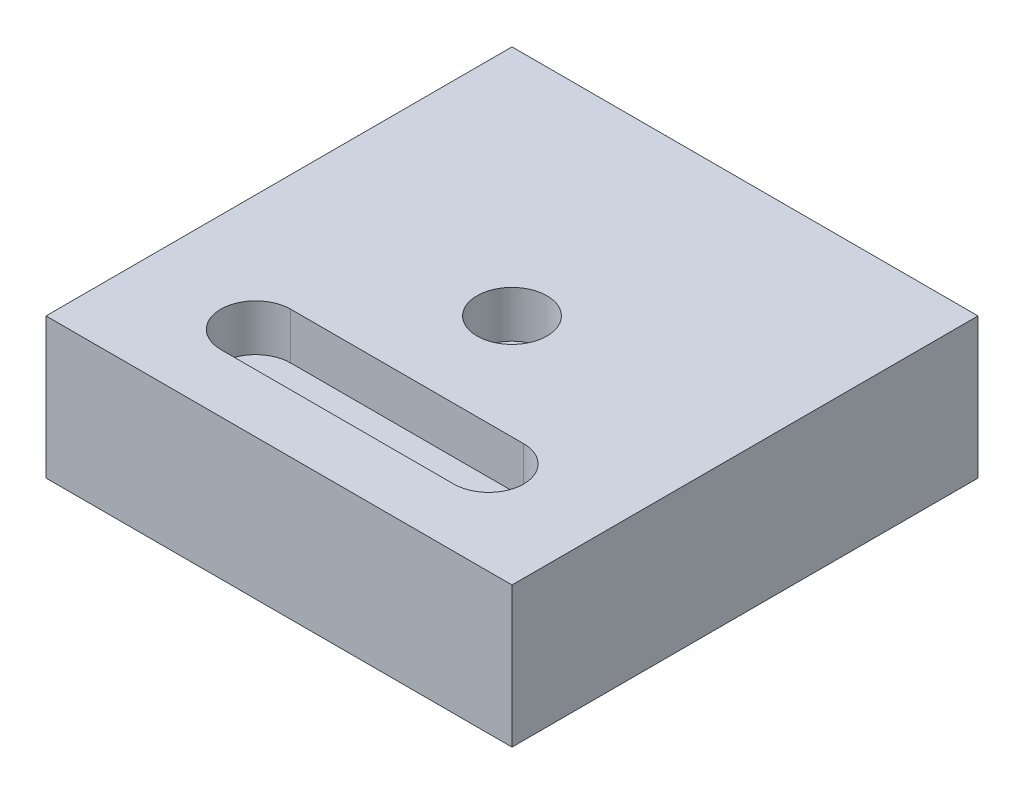
ISO-10303-21;
HEADER;
FILE_DESCRIPTION(('STEP AP214'),'2;1');
FILE_NAME('part.step','',(''),(''),'','','');
FILE_SCHEMA(('AUTOMOTIVE_DESIGN { 1 0 10303 214 1 1 1 1 }'));
ENDSEC;
DATA;
#1=APPLICATION_CONTEXT('core data for automotive mechanical design processes');
#2=APPLICATION_PROTOCOL_DEFINITION('international standard','automotive_design',2000,#1);
#3=PRODUCT_CONTEXT('',#1,'mechanical');
#4=PRODUCT('Part','Part','',(#3));
#5=PRODUCT_RELATED_PRODUCT_CATEGORY('part','',(#4));
#6=PRODUCT_DEFINITION_FORMATION('','',#4);
#7=PRODUCT_DEFINITION_CONTEXT('part definition',#1,'design');
#8=PRODUCT_DEFINITION('design','',#6,#7);
#9=PRODUCT_DEFINITION_SHAPE('','',#8);
#10=(LENGTH_UNIT() NAMED_UNIT(*) SI_UNIT(.MILLI.,.METRE.));
#11=(NAMED_UNIT(*) PLANE_ANGLE_UNIT() SI_UNIT($,.RADIAN.));
#12=(NAMED_UNIT(*) SI_UNIT($,.STERADIAN.) SOLID_ANGLE_UNIT());
#13=UNCERTAINTY_MEASURE_WITH_UNIT(LENGTH_MEASURE(1.E-05),#10,'distance_accuracy_value','');
#14=(GEOMETRIC_REPRESENTATION_CONTEXT(3) GLOBAL_UNCERTAINTY_ASSIGNED_CONTEXT((#13)) GLOBAL_UNIT_ASSIGNED_CONTEXT((#10,
#11,#12)) REPRESENTATION_CONTEXT('',''));
#15=CARTESIAN_POINT('',(0.,0.,0.));
#16=DIRECTION('',(0.,0.,1.));
#17=DIRECTION('',(1.,0.,0.));
#18=AXIS2_PLACEMENT_3D('',#15,#16,#17);
#19=CARTESIAN_POINT('',(50.,30.144123076788,50.));
#20=DIRECTION('',(-1.,0.,0.));
#21=DIRECTION('',(0.,0.,1.));
#22=AXIS2_PLACEMENT_3D('',#19,#20,#21);
#23=PLANE('',#22);
#24=DIRECTION('',(0.,0.,-1.));
#25=VECTOR('',#24,1.);
#26=CARTESIAN_POINT('',(50.,0.,50.));
#27=LINE('',#26,#25);
#28=CARTESIAN_POINT('',(50.,0.,50.));
#29=VERTEX_POINT('',#28);
#30=CARTESIAN_POINT('',(50.,0.,-50.));
#31=VERTEX_POINT('',#30);
#32=EDGE_CURVE('E194',#29,#31,#27,.T.);
#33=ORIENTED_EDGE('',*,*,#32,.T.);
#34=DIRECTION('',(0.,-1.,0.));
#35=VECTOR('',#34,1.);
#36=CARTESIAN_POINT('',(50.,30.144123076788,-50.));
#37=LINE('',#36,#35);
#38=CARTESIAN_POINT('',(50.,30.144123076788,-50.));
#39=VERTEX_POINT('',#38);
#40=EDGE_CURVE('E12',#39,#31,#37,.T.);
#41=ORIENTED_EDGE('',*,*,#40,.F.);
#42=DIRECTION('',(0.,0.,-1.));
#43=VECTOR('',#42,1.);
#44=CARTESIAN_POINT('',(50.,30.144123076788,50.));
#45=LINE('',#44,#43);
#46=CARTESIAN_POINT('',(50.,30.144123076788,50.));
#47=VERTEX_POINT('',#46);
#48=EDGE_CURVE('E187',#47,#39,#45,.T.);
#49=ORIENTED_EDGE('',*,*,#48,.F.);
#50=DIRECTION('',(0.,-1.,0.));
#51=VECTOR('',#50,1.);
#52=CARTESIAN_POINT('',(50.,30.144123076788,50.));
#53=LINE('',#52,#51);
#54=EDGE_CURVE('E193',#47,#29,#53,.T.);
#55=ORIENTED_EDGE('',*,*,#54,.T.);
#56=EDGE_LOOP('',(#33,#41,#49,#55));
#57=FACE_BOUND('',#56,.T.);
#58=ADVANCED_FACE('F73',(#57),#23,.F.);
#59=CARTESIAN_POINT('',(-50.,30.144123076788,-50.));
#60=DIRECTION('',(0.,0.,1.));
#61=DIRECTION('',(1.,0.,0.));
#62=AXIS2_PLACEMENT_3D('',#59,#60,#61);
#63=PLANE('',#62);
#64=DIRECTION('',(-1.,0.,0.));
#65=VECTOR('',#64,1.);
#66=CARTESIAN_POINT('',(-50.,0.,-50.));
#67=LINE('',#66,#65);
#68=CARTESIAN_POINT('',(-50.,0.,-50.));
#69=VERTEX_POINT('',#68);
#70=EDGE_CURVE('E197',#31,#69,#67,.T.);
#71=ORIENTED_EDGE('',*,*,#70,.T.);
#72=DIRECTION('',(0.,-1.,0.));
#73=VECTOR('',#72,1.);
#74=CARTESIAN_POINT('',(-50.,30.144123076788,-50.));
#75=LINE('',#74,#73);
#76=CARTESIAN_POINT('',(-50.,30.144123076788,-50.));
#77=VERTEX_POINT('',#76);
#78=EDGE_CURVE('E80',#77,#69,#75,.T.);
#79=ORIENTED_EDGE('',*,*,#78,.F.);
#80=DIRECTION('',(-1.,0.,0.));
#81=VECTOR('',#80,1.);
#82=CARTESIAN_POINT('',(-50.,30.144123076788,-50.));
#83=LINE('',#82,#81);
#84=EDGE_CURVE('E124',#39,#77,#83,.T.);
#85=ORIENTED_EDGE('',*,*,#84,.F.);
#86=ORIENTED_EDGE('',*,*,#40,.T.);
#87=EDGE_LOOP('',(#71,#79,#85,#86));
#88=FACE_BOUND('',#87,.T.);
#89=ADVANCED_FACE('F227',(#88),#63,.F.);
#90=CARTESIAN_POINT('',(-50.,30.144123076788,50.));
#91=DIRECTION('',(1.,0.,0.));
#92=DIRECTION('',(0.,0.,-1.));
#93=AXIS2_PLACEMENT_3D('',#90,#91,#92);
#94=PLANE('',#93);
#95=DIRECTION('',(0.,0.,1.));
#96=VECTOR('',#95,1.);
#97=CARTESIAN_POINT('',(-50.,0.,50.));
#98=LINE('',#97,#96);
#99=CARTESIAN_POINT('',(-50.,0.,50.));
#100=VERTEX_POINT('',#99);
#101=EDGE_CURVE('E200',#69,#100,#98,.T.);
#102=ORIENTED_EDGE('',*,*,#101,.T.);
#103=DIRECTION('',(0.,-1.,0.));
#104=VECTOR('',#103,1.);
#105=CARTESIAN_POINT('',(-50.,30.144123076788,50.));
#106=LINE('',#105,#104);
#107=CARTESIAN_POINT('',(-50.,30.144123076788,50.));
#108=VERTEX_POINT('',#107);
#109=EDGE_CURVE('E204',#108,#100,#106,.T.);
#110=ORIENTED_EDGE('',*,*,#109,.F.);
#111=DIRECTION('',(0.,0.,1.));
#112=VECTOR('',#111,1.);
#113=CARTESIAN_POINT('',(-50.,30.144123076788,50.));
#114=LINE('',#113,#112);
#115=EDGE_CURVE('E190',#77,#108,#114,.T.);
#116=ORIENTED_EDGE('',*,*,#115,.F.);
#117=ORIENTED_EDGE('',*,*,#78,.T.);
#118=EDGE_LOOP('',(#102,#110,#116,#117));
#119=FACE_BOUND('',#118,.T.);
#120=ADVANCED_FACE('F209',(#119),#94,.F.);
#121=CARTESIAN_POINT('',(-50.,30.144123076788,50.));
#122=DIRECTION('',(0.,0.,-1.));
#123=DIRECTION('',(-1.,0.,0.));
#124=AXIS2_PLACEMENT_3D('',#121,#122,#123);
#125=PLANE('',#124);
#126=DIRECTION('',(1.,0.,0.));
#127=VECTOR('',#126,1.);
#128=CARTESIAN_POINT('',(-50.,0.,50.));
#129=LINE('',#128,#127);
#130=EDGE_CURVE('E117',#100,#29,#129,.T.);
#131=ORIENTED_EDGE('',*,*,#130,.T.);
#132=ORIENTED_EDGE('',*,*,#54,.F.);
#133=DIRECTION('',(1.,0.,0.));
#134=VECTOR('',#133,1.);
#135=CARTESIAN_POINT('',(-50.,30.144123076788,50.));
#136=LINE('',#135,#134);
#137=EDGE_CURVE('E96',#108,#47,#136,.T.);
#138=ORIENTED_EDGE('',*,*,#137,.F.);
#139=ORIENTED_EDGE('',*,*,#109,.T.);
#140=EDGE_LOOP('',(#131,#132,#138,#139));
#141=FACE_BOUND('',#140,.T.);
#142=ADVANCED_FACE('F217',(#141),#125,.F.);
#143=CARTESIAN_POINT('',(0.,30.144123076788,0.));
#144=DIRECTION('',(0.,-1.,0.));
#145=DIRECTION('',(0.,0.,-1.));
#146=AXIS2_PLACEMENT_3D('',#143,#144,#145);
#147=PLANE('',#146);
#148=CARTESIAN_POINT('',(0.,30.144123076788,0.));
#149=DIRECTION('',(0.,1.,0.));
#150=DIRECTION('',(0.,0.,1.));
#151=AXIS2_PLACEMENT_3D('',#148,#149,#150);
#152=CIRCLE('',#151,7.5);
#153=CARTESIAN_POINT('',(0.,30.144123076788,7.5));
#154=VERTEX_POINT('',#153);
#155=EDGE_CURVE('E172',#154,#154,#152,.T.);
#156=ORIENTED_EDGE('',*,*,#155,.F.);
#157=EDGE_LOOP('',(#156));
#158=FACE_BOUND('',#157,.T.);
#159=DIRECTION('',(1.,0.,0.));
#160=VECTOR('',#159,1.);
#161=CARTESIAN_POINT('',(-25.,30.144123076788,37.5));
#162=LINE('',#161,#160);
#163=CARTESIAN_POINT('',(-25.,30.144123076788,37.5));
#164=VERTEX_POINT('',#163);
#165=CARTESIAN_POINT('',(25.,30.144123076788,37.5));
#166=VERTEX_POINT('',#165);
#167=EDGE_CURVE('E178',#164,#166,#162,.T.);
#168=ORIENTED_EDGE('',*,*,#167,.F.);
#169=CARTESIAN_POINT('',(-25.,30.144123076788,30.));
#170=DIRECTION('',(0.,1.,0.));
#171=DIRECTION('',(0.,0.,1.));
#172=AXIS2_PLACEMENT_3D('',#169,#170,#171);
#173=CIRCLE('',#172,7.5);
#174=CARTESIAN_POINT('',(-25.,30.144123076788,22.5));
#175=VERTEX_POINT('',#174);
#176=EDGE_CURVE('E87',#175,#164,#173,.T.);
#177=ORIENTED_EDGE('',*,*,#176,.F.);
#178=DIRECTION('',(-1.,0.,0.));
#179=VECTOR('',#178,1.);
#180=CARTESIAN_POINT('',(-25.,30.144123076788,22.5));
#181=LINE('',#180,#179);
#182=CARTESIAN_POINT('',(25.,30.144123076788,22.5));
#183=VERTEX_POINT('',#182);
#184=EDGE_CURVE('E166',#183,#175,#181,.T.);
#185=ORIENTED_EDGE('',*,*,#184,.F.);
#186=CARTESIAN_POINT('',(25.,30.144123076788,30.));
#187=DIRECTION('',(0.,1.,0.));
#188=DIRECTION('',(0.,0.,1.));
#189=AXIS2_PLACEMENT_3D('',#186,#187,#188);
#190=CIRCLE('',#189,7.5);
#191=EDGE_CURVE('E169',#166,#183,#190,.T.);
#192=ORIENTED_EDGE('',*,*,#191,.F.);
#193=EDGE_LOOP('',(#168,#177,#185,#192));
#194=FACE_BOUND('',#193,.T.);
#195=ORIENTED_EDGE('',*,*,#48,.T.);
#196=ORIENTED_EDGE('',*,*,#84,.T.);
#197=ORIENTED_EDGE('',*,*,#115,.T.);
#198=ORIENTED_EDGE('',*,*,#137,.T.);
#199=EDGE_LOOP('',(#195,#196,#197,#198));
#200=FACE_BOUND('',#199,.T.);
#201=ADVANCED_FACE('F219',(#158,#194,#200),#147,.F.);
#202=CARTESIAN_POINT('',(0.,0.,0.));
#203=DIRECTION('',(0.,-1.,0.));
#204=DIRECTION('',(0.,0.,-1.));
#205=AXIS2_PLACEMENT_3D('',#202,#203,#204);
#206=PLANE('',#205);
#207=ORIENTED_EDGE('',*,*,#32,.F.);
#208=ORIENTED_EDGE('',*,*,#130,.F.);
#209=ORIENTED_EDGE('',*,*,#101,.F.);
#210=ORIENTED_EDGE('',*,*,#70,.F.);
#211=EDGE_LOOP('',(#207,#208,#209,#210));
#212=FACE_BOUND('',#211,.T.);
#213=ADVANCED_FACE('F213',(#212),#206,.T.);
#214=CARTESIAN_POINT('',(-25.,20.144123076788,30.));
#215=DIRECTION('',(0.,1.,0.));
#216=DIRECTION('',(0.,0.,1.));
#217=AXIS2_PLACEMENT_3D('',#214,#215,#216);
#218=CYLINDRICAL_SURFACE('',#217,7.5);
#219=ORIENTED_EDGE('',*,*,#176,.T.);
#220=DIRECTION('',(0.,1.,0.));
#221=VECTOR('',#220,1.);
#222=CARTESIAN_POINT('',(-25.,20.144123076788,37.5));
#223=LINE('',#222,#221);
#224=CARTESIAN_POINT('',(-25.,20.144123076788,37.5));
#225=VERTEX_POINT('',#224);
#226=EDGE_CURVE('E144',#225,#164,#223,.T.);
#227=ORIENTED_EDGE('',*,*,#226,.F.);
#228=CARTESIAN_POINT('',(-25.,20.144123076788,30.));
#229=DIRECTION('',(0.,1.,0.));
#230=DIRECTION('',(0.,0.,1.));
#231=AXIS2_PLACEMENT_3D('',#228,#229,#230);
#232=CIRCLE('',#231,7.5);
#233=CARTESIAN_POINT('',(-25.,20.144123076788,22.5));
#234=VERTEX_POINT('',#233);
#235=EDGE_CURVE('E148',#234,#225,#232,.T.);
#236=ORIENTED_EDGE('',*,*,#235,.F.);
#237=DIRECTION('',(0.,1.,0.));
#238=VECTOR('',#237,1.);
#239=CARTESIAN_POINT('',(-25.,20.144123076788,22.5));
#240=LINE('',#239,#238);
#241=EDGE_CURVE('E182',#234,#175,#240,.T.);
#242=ORIENTED_EDGE('',*,*,#241,.T.);
#243=EDGE_LOOP('',(#219,#227,#236,#242));
#244=FACE_BOUND('',#243,.T.);
#245=ADVANCED_FACE('F146',(#244),#218,.F.);
#246=CARTESIAN_POINT('',(-25.,20.144123076788,22.5));
#247=DIRECTION('',(0.,0.,-1.));
#248=DIRECTION('',(-1.,0.,0.));
#249=AXIS2_PLACEMENT_3D('',#246,#247,#248);
#250=PLANE('',#249);
#251=ORIENTED_EDGE('',*,*,#184,.T.);
#252=ORIENTED_EDGE('',*,*,#241,.F.);
#253=DIRECTION('',(-1.,0.,0.));
#254=VECTOR('',#253,1.);
#255=CARTESIAN_POINT('',(-25.,20.144123076788,22.5));
#256=LINE('',#255,#254);
#257=CARTESIAN_POINT('',(25.,20.144123076788,22.5));
#258=VERTEX_POINT('',#257);
#259=EDGE_CURVE('E154',#258,#234,#256,.T.);
#260=ORIENTED_EDGE('',*,*,#259,.F.);
#261=DIRECTION('',(0.,1.,0.));
#262=VECTOR('',#261,1.);
#263=CARTESIAN_POINT('',(25.,20.144123076788,22.5));
#264=LINE('',#263,#262);
#265=EDGE_CURVE('E184',#258,#183,#264,.T.);
#266=ORIENTED_EDGE('',*,*,#265,.T.);
#267=EDGE_LOOP('',(#251,#252,#260,#266));
#268=FACE_BOUND('',#267,.T.);
#269=ADVANCED_FACE('F266',(#268),#250,.F.);
#270=CARTESIAN_POINT('',(25.,20.144123076788,30.));
#271=DIRECTION('',(0.,1.,0.));
#272=DIRECTION('',(0.,0.,1.));
#273=AXIS2_PLACEMENT_3D('',#270,#271,#272);
#274=CYLINDRICAL_SURFACE('',#273,7.5);
#275=ORIENTED_EDGE('',*,*,#191,.T.);
#276=ORIENTED_EDGE('',*,*,#265,.F.);
#277=CARTESIAN_POINT('',(25.,20.144123076788,30.));
#278=DIRECTION('',(0.,1.,0.));
#279=DIRECTION('',(0.,0.,1.));
#280=AXIS2_PLACEMENT_3D('',#277,#278,#279);
#281=CIRCLE('',#280,7.5);
#282=CARTESIAN_POINT('',(25.,20.144123076788,37.5));
#283=VERTEX_POINT('',#282);
#284=EDGE_CURVE('E162',#283,#258,#281,.T.);
#285=ORIENTED_EDGE('',*,*,#284,.F.);
#286=DIRECTION('',(0.,1.,0.));
#287=VECTOR('',#286,1.);
#288=CARTESIAN_POINT('',(25.,20.144123076788,37.5));
#289=LINE('',#288,#287);
#290=EDGE_CURVE('E153',#283,#166,#289,.T.);
#291=ORIENTED_EDGE('',*,*,#290,.T.);
#292=EDGE_LOOP('',(#275,#276,#285,#291));
#293=FACE_BOUND('',#292,.T.);
#294=ADVANCED_FACE('F275',(#293),#274,.F.);
#295=CARTESIAN_POINT('',(-25.,20.144123076788,37.5));
#296=DIRECTION('',(0.,0.,1.));
#297=DIRECTION('',(1.,0.,0.));
#298=AXIS2_PLACEMENT_3D('',#295,#296,#297);
#299=PLANE('',#298);
#300=ORIENTED_EDGE('',*,*,#167,.T.);
#301=ORIENTED_EDGE('',*,*,#290,.F.);
#302=DIRECTION('',(1.,0.,0.));
#303=VECTOR('',#302,1.);
#304=CARTESIAN_POINT('',(-25.,20.144123076788,37.5));
#305=LINE('',#304,#303);
#306=EDGE_CURVE('E157',#225,#283,#305,.T.);
#307=ORIENTED_EDGE('',*,*,#306,.F.);
#308=ORIENTED_EDGE('',*,*,#226,.T.);
#309=EDGE_LOOP('',(#300,#301,#307,#308));
#310=FACE_BOUND('',#309,.T.);
#311=ADVANCED_FACE('F158',(#310),#299,.F.);
#312=CARTESIAN_POINT('',(-25.,20.144123076788,30.));
#313=DIRECTION('',(0.,1.,0.));
#314=DIRECTION('',(0.,0.,1.));
#315=AXIS2_PLACEMENT_3D('',#312,#313,#314);
#316=PLANE('',#315);
#317=ORIENTED_EDGE('',*,*,#235,.T.);
#318=ORIENTED_EDGE('',*,*,#306,.T.);
#319=ORIENTED_EDGE('',*,*,#284,.T.);
#320=ORIENTED_EDGE('',*,*,#259,.T.);
#321=EDGE_LOOP('',(#317,#318,#319,#320));
#322=FACE_BOUND('',#321,.T.);
#323=ADVANCED_FACE('F164',(#322),#316,.T.);
#324=CARTESIAN_POINT('',(0.,20.144123076788,0.));
#325=DIRECTION('',(0.,1.,0.));
#326=DIRECTION('',(0.,0.,1.));
#327=AXIS2_PLACEMENT_3D('',#324,#325,#326);
#328=CYLINDRICAL_SURFACE('',#327,7.5);
#329=CARTESIAN_POINT('',(0.,20.144123076788,0.));
#330=DIRECTION('',(0.,1.,0.));
#331=DIRECTION('',(0.,0.,1.));
#332=AXIS2_PLACEMENT_3D('',#329,#330,#331);
#333=CIRCLE('',#332,7.5);
#334=CARTESIAN_POINT('',(0.,20.144123076788,7.5));
#335=VERTEX_POINT('',#334);
#336=EDGE_CURVE('E198',#335,#335,#333,.T.);
#337=ORIENTED_EDGE('',*,*,#336,.F.);
#338=EDGE_LOOP('',(#337));
#339=FACE_BOUND('',#338,.T.);
#340=ORIENTED_EDGE('',*,*,#155,.T.);
#341=EDGE_LOOP('',(#340));
#342=FACE_BOUND('',#341,.T.);
#343=ADVANCED_FACE('F302',(#339,#342),#328,.F.);
#344=CARTESIAN_POINT('',(0.,20.144123076788,0.));
#345=DIRECTION('',(0.,1.,0.));
#346=DIRECTION('',(0.,0.,1.));
#347=AXIS2_PLACEMENT_3D('',#344,#345,#346);
#348=PLANE('',#347);
#349=ORIENTED_EDGE('',*,*,#336,.T.);
#350=EDGE_LOOP('',(#349));
#351=FACE_BOUND('',#350,.T.);
#352=ADVANCED_FACE('F311',(#351),#348,.T.);
#353=CLOSED_SHELL('',(#58,#89,#120,#142,#201,#213,#245,#269,#294,#311,#323,#343,#352));
#354=MANIFOLD_SOLID_BREP('B2',#353);
#355=ADVANCED_BREP_SHAPE_REPRESENTATION('',(#18,#354),#14);
#356=SHAPE_DEFINITION_REPRESENTATION(#9,#355);
ENDSEC;
END-ISO-10303-21;
